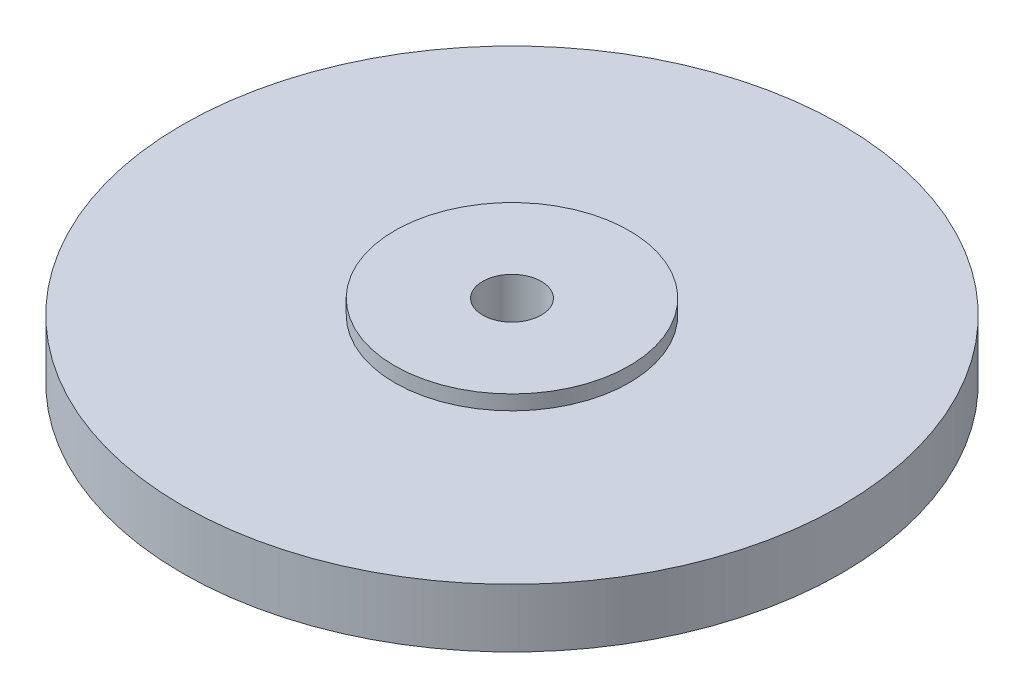
ISO-10303-21;
HEADER;
FILE_DESCRIPTION(('STEP AP214'),'2;1');
FILE_NAME('part.step','',(''),(''),'','','');
FILE_SCHEMA(('AUTOMOTIVE_DESIGN { 1 0 10303 214 1 1 1 1 }'));
ENDSEC;
DATA;
#1=APPLICATION_CONTEXT('core data for automotive mechanical design processes');
#2=APPLICATION_PROTOCOL_DEFINITION('international standard','automotive_design',2000,#1);
#3=PRODUCT_CONTEXT('',#1,'mechanical');
#4=PRODUCT('Part','Part','',(#3));
#5=PRODUCT_RELATED_PRODUCT_CATEGORY('part','',(#4));
#6=PRODUCT_DEFINITION_FORMATION('','',#4);
#7=PRODUCT_DEFINITION_CONTEXT('part definition',#1,'design');
#8=PRODUCT_DEFINITION('design','',#6,#7);
#9=PRODUCT_DEFINITION_SHAPE('','',#8);
#10=(LENGTH_UNIT() NAMED_UNIT(*) SI_UNIT(.MILLI.,.METRE.));
#11=(NAMED_UNIT(*) PLANE_ANGLE_UNIT() SI_UNIT($,.RADIAN.));
#12=(NAMED_UNIT(*) SI_UNIT($,.STERADIAN.) SOLID_ANGLE_UNIT());
#13=UNCERTAINTY_MEASURE_WITH_UNIT(LENGTH_MEASURE(1.E-05),#10,'distance_accuracy_value','');
#14=(GEOMETRIC_REPRESENTATION_CONTEXT(3) GLOBAL_UNCERTAINTY_ASSIGNED_CONTEXT((#13)) GLOBAL_UNIT_ASSIGNED_CONTEXT((#10,
#11,#12)) REPRESENTATION_CONTEXT('',''));
#15=CARTESIAN_POINT('',(0.,0.,0.));
#16=DIRECTION('',(0.,0.,1.));
#17=DIRECTION('',(1.,0.,0.));
#18=AXIS2_PLACEMENT_3D('',#15,#16,#17);
#19=CARTESIAN_POINT('',(2.,-13.,0.));
#20=DIRECTION('',(0.,1.,0.));
#21=DIRECTION('',(0.,0.,1.));
#22=AXIS2_PLACEMENT_3D('',#19,#20,#21);
#23=PLANE('',#22);
#24=CARTESIAN_POINT('',(0.,-13.,0.));
#25=DIRECTION('',(0.,1.,0.));
#26=DIRECTION('',(0.,0.,1.));
#27=AXIS2_PLACEMENT_3D('',#24,#25,#26);
#28=CIRCLE('',#27,4.);
#29=CARTESIAN_POINT('',(0.,-13.,4.));
#30=VERTEX_POINT('',#29);
#31=EDGE_CURVE('E12',#30,#30,#28,.T.);
#32=ORIENTED_EDGE('',*,*,#31,.F.);
#33=EDGE_LOOP('',(#32));
#34=FACE_BOUND('',#33,.T.);
#35=CARTESIAN_POINT('',(0.,-13.,0.));
#36=DIRECTION('',(0.,1.,0.));
#37=DIRECTION('',(0.,0.,1.));
#38=AXIS2_PLACEMENT_3D('',#35,#36,#37);
#39=CIRCLE('',#38,2.);
#40=CARTESIAN_POINT('',(0.,-13.,2.));
#41=VERTEX_POINT('',#40);
#42=EDGE_CURVE('E73',#41,#41,#39,.T.);
#43=ORIENTED_EDGE('',*,*,#42,.T.);
#44=EDGE_LOOP('',(#43));
#45=FACE_BOUND('',#44,.T.);
#46=ADVANCED_FACE('F45',(#34,#45),#23,.F.);
#47=CARTESIAN_POINT('',(0.,8.62657632471953,0.));
#48=DIRECTION('',(0.,1.,0.));
#49=DIRECTION('',(0.,0.,1.));
#50=AXIS2_PLACEMENT_3D('',#47,#48,#49);
#51=CYLINDRICAL_SURFACE('',#50,4.);
#52=CARTESIAN_POINT('',(0.,-2.,0.));
#53=DIRECTION('',(0.,1.,0.));
#54=DIRECTION('',(0.,0.,1.));
#55=AXIS2_PLACEMENT_3D('',#52,#53,#54);
#56=CIRCLE('',#55,4.);
#57=CARTESIAN_POINT('',(0.,-2.,4.));
#58=VERTEX_POINT('',#57);
#59=EDGE_CURVE('E51',#58,#58,#56,.T.);
#60=ORIENTED_EDGE('',*,*,#59,.F.);
#61=EDGE_LOOP('',(#60));
#62=FACE_BOUND('',#61,.T.);
#63=ORIENTED_EDGE('',*,*,#31,.T.);
#64=EDGE_LOOP('',(#63));
#65=FACE_BOUND('',#64,.T.);
#66=ADVANCED_FACE('F110',(#62,#65),#51,.T.);
#67=CARTESIAN_POINT('',(4.,-2.,0.));
#68=DIRECTION('',(0.,1.,0.));
#69=DIRECTION('',(0.,0.,1.));
#70=AXIS2_PLACEMENT_3D('',#67,#68,#69);
#71=PLANE('',#70);
#72=CARTESIAN_POINT('',(0.,-2.,0.));
#73=DIRECTION('',(0.,1.,0.));
#74=DIRECTION('',(0.,0.,1.));
#75=AXIS2_PLACEMENT_3D('',#72,#73,#74);
#76=CIRCLE('',#75,22.5);
#77=CARTESIAN_POINT('',(0.,-2.,22.5));
#78=VERTEX_POINT('',#77);
#79=EDGE_CURVE('E55',#78,#78,#76,.T.);
#80=ORIENTED_EDGE('',*,*,#79,.F.);
#81=EDGE_LOOP('',(#80));
#82=FACE_BOUND('',#81,.T.);
#83=ORIENTED_EDGE('',*,*,#59,.T.);
#84=EDGE_LOOP('',(#83));
#85=FACE_BOUND('',#84,.T.);
#86=ADVANCED_FACE('F105',(#82,#85),#71,.F.);
#87=CARTESIAN_POINT('',(0.,8.62657632471953,0.));
#88=DIRECTION('',(0.,1.,0.));
#89=DIRECTION('',(0.,0.,1.));
#90=AXIS2_PLACEMENT_3D('',#87,#88,#89);
#91=CYLINDRICAL_SURFACE('',#90,22.5);
#92=CARTESIAN_POINT('',(0.,2.,0.));
#93=DIRECTION('',(0.,1.,0.));
#94=DIRECTION('',(0.,0.,1.));
#95=AXIS2_PLACEMENT_3D('',#92,#93,#94);
#96=CIRCLE('',#95,22.5);
#97=CARTESIAN_POINT('',(0.,2.,22.5));
#98=VERTEX_POINT('',#97);
#99=EDGE_CURVE('E59',#98,#98,#96,.T.);
#100=ORIENTED_EDGE('',*,*,#99,.F.);
#101=EDGE_LOOP('',(#100));
#102=FACE_BOUND('',#101,.T.);
#103=ORIENTED_EDGE('',*,*,#79,.T.);
#104=EDGE_LOOP('',(#103));
#105=FACE_BOUND('',#104,.T.);
#106=ADVANCED_FACE('F99',(#102,#105),#91,.T.);
#107=CARTESIAN_POINT('',(22.5,2.,0.));
#108=DIRECTION('',(0.,-1.,0.));
#109=DIRECTION('',(0.,0.,-1.));
#110=AXIS2_PLACEMENT_3D('',#107,#108,#109);
#111=PLANE('',#110);
#112=CARTESIAN_POINT('',(0.,2.,0.));
#113=DIRECTION('',(0.,1.,0.));
#114=DIRECTION('',(0.,0.,1.));
#115=AXIS2_PLACEMENT_3D('',#112,#113,#114);
#116=CIRCLE('',#115,8.);
#117=CARTESIAN_POINT('',(0.,2.,8.));
#118=VERTEX_POINT('',#117);
#119=EDGE_CURVE('E64',#118,#118,#116,.T.);
#120=ORIENTED_EDGE('',*,*,#119,.F.);
#121=EDGE_LOOP('',(#120));
#122=FACE_BOUND('',#121,.T.);
#123=ORIENTED_EDGE('',*,*,#99,.T.);
#124=EDGE_LOOP('',(#123));
#125=FACE_BOUND('',#124,.T.);
#126=ADVANCED_FACE('F93',(#122,#125),#111,.F.);
#127=CARTESIAN_POINT('',(0.,8.62657632471953,0.));
#128=DIRECTION('',(0.,1.,0.));
#129=DIRECTION('',(0.,0.,1.));
#130=AXIS2_PLACEMENT_3D('',#127,#128,#129);
#131=CYLINDRICAL_SURFACE('',#130,8.);
#132=CARTESIAN_POINT('',(0.,3.,0.));
#133=DIRECTION('',(0.,1.,0.));
#134=DIRECTION('',(0.,0.,1.));
#135=AXIS2_PLACEMENT_3D('',#132,#133,#134);
#136=CIRCLE('',#135,8.);
#137=CARTESIAN_POINT('',(0.,3.,8.));
#138=VERTEX_POINT('',#137);
#139=EDGE_CURVE('E67',#138,#138,#136,.T.);
#140=ORIENTED_EDGE('',*,*,#139,.F.);
#141=EDGE_LOOP('',(#140));
#142=FACE_BOUND('',#141,.T.);
#143=ORIENTED_EDGE('',*,*,#119,.T.);
#144=EDGE_LOOP('',(#143));
#145=FACE_BOUND('',#144,.T.);
#146=ADVANCED_FACE('F87',(#142,#145),#131,.T.);
#147=CARTESIAN_POINT('',(8.,3.,0.));
#148=DIRECTION('',(0.,-1.,0.));
#149=DIRECTION('',(0.,0.,-1.));
#150=AXIS2_PLACEMENT_3D('',#147,#148,#149);
#151=PLANE('',#150);
#152=CARTESIAN_POINT('',(0.,3.,0.));
#153=DIRECTION('',(0.,1.,0.));
#154=DIRECTION('',(0.,0.,1.));
#155=AXIS2_PLACEMENT_3D('',#152,#153,#154);
#156=CIRCLE('',#155,2.);
#157=CARTESIAN_POINT('',(0.,3.,2.));
#158=VERTEX_POINT('',#157);
#159=EDGE_CURVE('E70',#158,#158,#156,.T.);
#160=ORIENTED_EDGE('',*,*,#159,.F.);
#161=EDGE_LOOP('',(#160));
#162=FACE_BOUND('',#161,.T.);
#163=ORIENTED_EDGE('',*,*,#139,.T.);
#164=EDGE_LOOP('',(#163));
#165=FACE_BOUND('',#164,.T.);
#166=ADVANCED_FACE('F81',(#162,#165),#151,.F.);
#167=CARTESIAN_POINT('',(0.,8.62657632471953,0.));
#168=DIRECTION('',(0.,1.,0.));
#169=DIRECTION('',(0.,0.,1.));
#170=AXIS2_PLACEMENT_3D('',#167,#168,#169);
#171=CYLINDRICAL_SURFACE('',#170,2.);
#172=ORIENTED_EDGE('',*,*,#42,.F.);
#173=EDGE_LOOP('',(#172));
#174=FACE_BOUND('',#173,.T.);
#175=ORIENTED_EDGE('',*,*,#159,.T.);
#176=EDGE_LOOP('',(#175));
#177=FACE_BOUND('',#176,.T.);
#178=ADVANCED_FACE('F78',(#174,#177),#171,.F.);
#179=CLOSED_SHELL('',(#46,#66,#86,#106,#126,#146,#166,#178));
#180=MANIFOLD_SOLID_BREP('B2',#179);
#181=ADVANCED_BREP_SHAPE_REPRESENTATION('',(#18,#180),#14);
#182=SHAPE_DEFINITION_REPRESENTATION(#9,#181);
ENDSEC;
END-ISO-10303-21;
